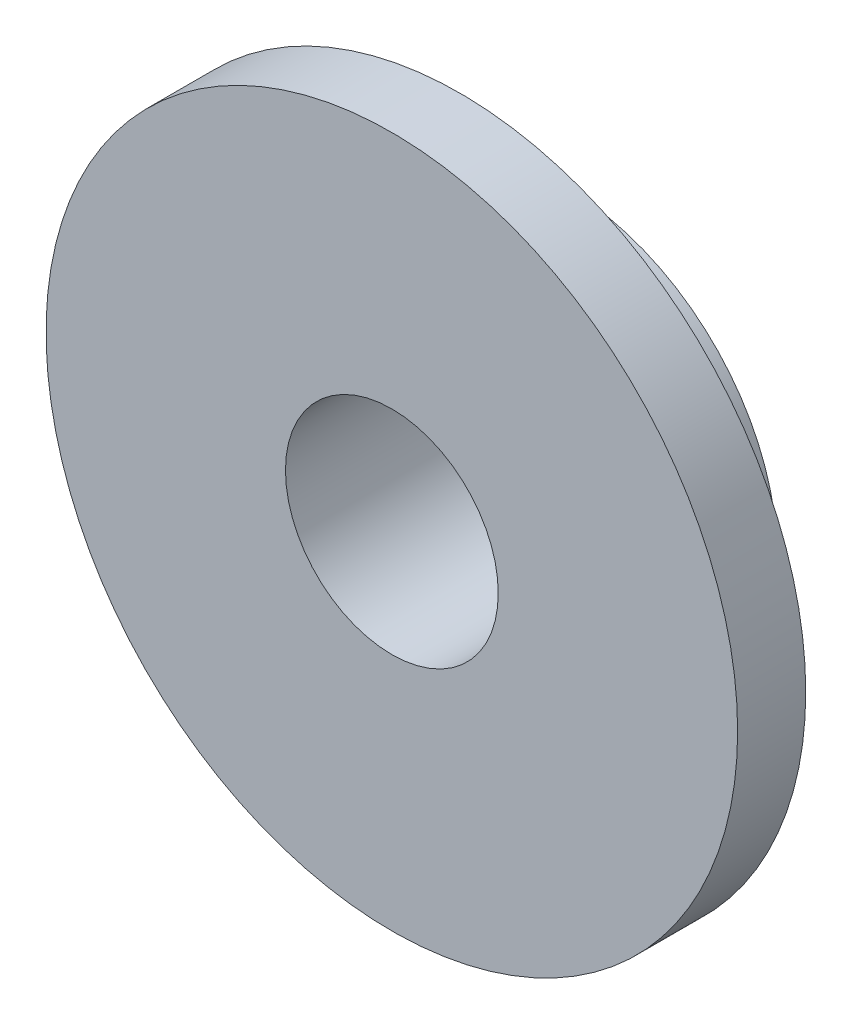
ISO-10303-21;
HEADER;
FILE_DESCRIPTION(('STEP AP214'),'2;1');
FILE_NAME('part.step','',(''),(''),'','','');
FILE_SCHEMA(('AUTOMOTIVE_DESIGN { 1 0 10303 214 1 1 1 1 }'));
ENDSEC;
DATA;
#1=APPLICATION_CONTEXT('core data for automotive mechanical design processes');
#2=APPLICATION_PROTOCOL_DEFINITION('international standard','automotive_design',2000,#1);
#3=PRODUCT_CONTEXT('',#1,'mechanical');
#4=PRODUCT('Part','Part','',(#3));
#5=PRODUCT_RELATED_PRODUCT_CATEGORY('part','',(#4));
#6=PRODUCT_DEFINITION_FORMATION('','',#4);
#7=PRODUCT_DEFINITION_CONTEXT('part definition',#1,'design');
#8=PRODUCT_DEFINITION('design','',#6,#7);
#9=PRODUCT_DEFINITION_SHAPE('','',#8);
#10=(LENGTH_UNIT() NAMED_UNIT(*) SI_UNIT(.MILLI.,.METRE.));
#11=(NAMED_UNIT(*) PLANE_ANGLE_UNIT() SI_UNIT($,.RADIAN.));
#12=(NAMED_UNIT(*) SI_UNIT($,.STERADIAN.) SOLID_ANGLE_UNIT());
#13=UNCERTAINTY_MEASURE_WITH_UNIT(LENGTH_MEASURE(1.E-05),#10,'distance_accuracy_value','');
#14=(GEOMETRIC_REPRESENTATION_CONTEXT(3) GLOBAL_UNCERTAINTY_ASSIGNED_CONTEXT((#13)) GLOBAL_UNIT_ASSIGNED_CONTEXT((#10,
#11,#12)) REPRESENTATION_CONTEXT('',''));
#15=CARTESIAN_POINT('',(0.,0.,0.));
#16=DIRECTION('',(0.,0.,1.));
#17=DIRECTION('',(1.,0.,0.));
#18=AXIS2_PLACEMENT_3D('',#15,#16,#17);
#19=CARTESIAN_POINT('',(0.,0.,0.));
#20=DIRECTION('',(0.,0.,1.));
#21=DIRECTION('',(1.,0.,0.));
#22=AXIS2_PLACEMENT_3D('',#19,#20,#21);
#23=PLANE('',#22);
#24=CARTESIAN_POINT('',(0.,0.,0.));
#25=DIRECTION('',(0.,0.,1.));
#26=DIRECTION('',(1.,0.,0.));
#27=AXIS2_PLACEMENT_3D('',#24,#25,#26);
#28=CIRCLE('',#27,20.6375);
#29=CARTESIAN_POINT('',(20.6375,0.,0.));
#30=VERTEX_POINT('',#29);
#31=EDGE_CURVE('E42',#30,#30,#28,.T.);
#32=ORIENTED_EDGE('',*,*,#31,.F.);
#33=EDGE_LOOP('',(#32));
#34=FACE_BOUND('',#33,.T.);
#35=CARTESIAN_POINT('',(0.,0.,0.));
#36=DIRECTION('',(0.,0.,1.));
#37=DIRECTION('',(1.,0.,0.));
#38=AXIS2_PLACEMENT_3D('',#35,#36,#37);
#39=CIRCLE('',#38,12.7);
#40=CARTESIAN_POINT('',(12.7,0.,0.));
#41=VERTEX_POINT('',#40);
#42=EDGE_CURVE('E10',#41,#41,#39,.F.);
#43=ORIENTED_EDGE('',*,*,#42,.F.);
#44=EDGE_LOOP('',(#43));
#45=FACE_BOUND('',#44,.T.);
#46=ADVANCED_FACE('F31',(#34,#45),#23,.F.);
#47=CARTESIAN_POINT('',(0.,0.,4.064));
#48=DIRECTION('',(0.,0.,1.));
#49=DIRECTION('',(1.,0.,0.));
#50=AXIS2_PLACEMENT_3D('',#47,#48,#49);
#51=PLANE('',#50);
#52=CARTESIAN_POINT('',(0.,0.,4.064));
#53=DIRECTION('',(0.,0.,1.));
#54=DIRECTION('',(1.,0.,0.));
#55=AXIS2_PLACEMENT_3D('',#52,#53,#54);
#56=CIRCLE('',#55,20.6375);
#57=CARTESIAN_POINT('',(20.6375,0.,4.064));
#58=VERTEX_POINT('',#57);
#59=EDGE_CURVE('E38',#58,#58,#56,.T.);
#60=ORIENTED_EDGE('',*,*,#59,.T.);
#61=EDGE_LOOP('',(#60));
#62=FACE_BOUND('',#61,.T.);
#63=CARTESIAN_POINT('',(0.,0.,4.064));
#64=DIRECTION('',(0.,0.,1.));
#65=DIRECTION('',(1.,0.,0.));
#66=AXIS2_PLACEMENT_3D('',#63,#64,#65);
#67=CIRCLE('',#66,6.35);
#68=CARTESIAN_POINT('',(6.35,0.,4.064));
#69=VERTEX_POINT('',#68);
#70=EDGE_CURVE('E47',#69,#69,#67,.T.);
#71=ORIENTED_EDGE('',*,*,#70,.F.);
#72=EDGE_LOOP('',(#71));
#73=FACE_BOUND('',#72,.T.);
#74=ADVANCED_FACE('F74',(#62,#73),#51,.T.);
#75=CARTESIAN_POINT('',(0.,0.,4.064));
#76=DIRECTION('',(0.,0.,-1.));
#77=DIRECTION('',(-1.,0.,0.));
#78=AXIS2_PLACEMENT_3D('',#75,#76,#77);
#79=CYLINDRICAL_SURFACE('',#78,20.6375);
#80=ORIENTED_EDGE('',*,*,#59,.F.);
#81=EDGE_LOOP('',(#80));
#82=FACE_BOUND('',#81,.T.);
#83=ORIENTED_EDGE('',*,*,#31,.T.);
#84=EDGE_LOOP('',(#83));
#85=FACE_BOUND('',#84,.T.);
#86=ADVANCED_FACE('F33',(#82,#85),#79,.T.);
#87=CARTESIAN_POINT('',(0.,0.,4.064));
#88=DIRECTION('',(0.,0.,-1.));
#89=DIRECTION('',(-1.,0.,0.));
#90=AXIS2_PLACEMENT_3D('',#87,#88,#89);
#91=CYLINDRICAL_SURFACE('',#90,6.35);
#92=ORIENTED_EDGE('',*,*,#70,.T.);
#93=EDGE_LOOP('',(#92));
#94=FACE_BOUND('',#93,.T.);
#95=CARTESIAN_POINT('',(0.,0.,-6.223));
#96=DIRECTION('',(0.,0.,-1.));
#97=DIRECTION('',(-1.,0.,0.));
#98=AXIS2_PLACEMENT_3D('',#95,#96,#97);
#99=CIRCLE('',#98,6.35);
#100=CARTESIAN_POINT('',(-6.35,0.,-6.223));
#101=VERTEX_POINT('',#100);
#102=EDGE_CURVE('E54',#101,#101,#99,.T.);
#103=ORIENTED_EDGE('',*,*,#102,.T.);
#104=EDGE_LOOP('',(#103));
#105=FACE_BOUND('',#104,.T.);
#106=ADVANCED_FACE('F58',(#94,#105),#91,.F.);
#107=CARTESIAN_POINT('',(0.,0.,-6.223));
#108=DIRECTION('',(0.,0.,-1.));
#109=DIRECTION('',(-1.,0.,0.));
#110=AXIS2_PLACEMENT_3D('',#107,#108,#109);
#111=PLANE('',#110);
#112=CARTESIAN_POINT('',(0.,0.,-6.223));
#113=DIRECTION('',(0.,0.,-1.));
#114=DIRECTION('',(-1.,0.,0.));
#115=AXIS2_PLACEMENT_3D('',#112,#113,#114);
#116=CIRCLE('',#115,12.7);
#117=CARTESIAN_POINT('',(-12.7,0.,-6.223));
#118=VERTEX_POINT('',#117);
#119=EDGE_CURVE('E51',#118,#118,#116,.T.);
#120=ORIENTED_EDGE('',*,*,#119,.T.);
#121=EDGE_LOOP('',(#120));
#122=FACE_BOUND('',#121,.T.);
#123=ORIENTED_EDGE('',*,*,#102,.F.);
#124=EDGE_LOOP('',(#123));
#125=FACE_BOUND('',#124,.T.);
#126=ADVANCED_FACE('F60',(#122,#125),#111,.T.);
#127=CARTESIAN_POINT('',(0.,0.,-6.223));
#128=DIRECTION('',(0.,0.,1.));
#129=DIRECTION('',(1.,0.,0.));
#130=AXIS2_PLACEMENT_3D('',#127,#128,#129);
#131=CYLINDRICAL_SURFACE('',#130,12.7);
#132=ORIENTED_EDGE('',*,*,#119,.F.);
#133=EDGE_LOOP('',(#132));
#134=FACE_BOUND('',#133,.T.);
#135=ORIENTED_EDGE('',*,*,#42,.T.);
#136=EDGE_LOOP('',(#135));
#137=FACE_BOUND('',#136,.T.);
#138=ADVANCED_FACE('F62',(#134,#137),#131,.T.);
#139=CLOSED_SHELL('',(#46,#74,#86,#106,#126,#138));
#140=MANIFOLD_SOLID_BREP('B2',#139);
#141=ADVANCED_BREP_SHAPE_REPRESENTATION('',(#18,#140),#14);
#142=SHAPE_DEFINITION_REPRESENTATION(#9,#141);
ENDSEC;
END-ISO-10303-21;
